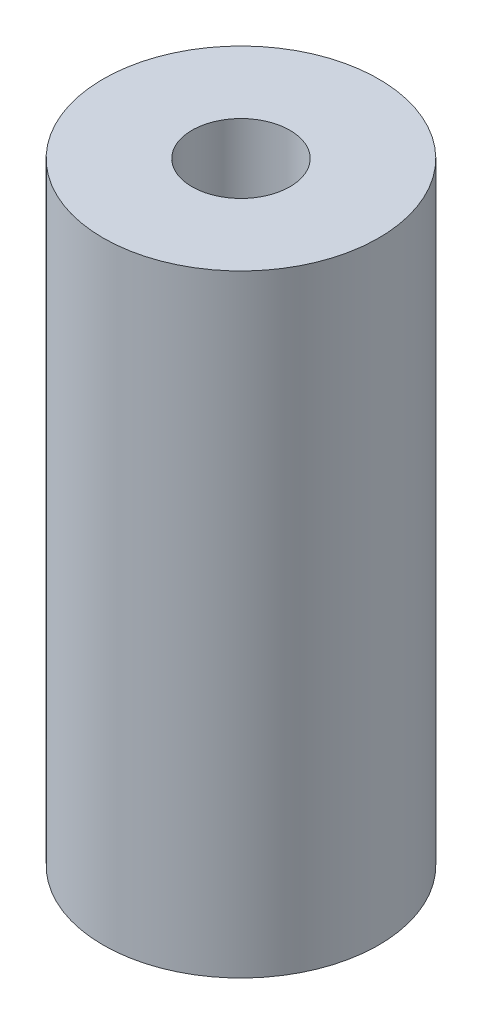
ISO-10303-21;
HEADER;
FILE_DESCRIPTION(('STEP AP214'),'2;1');
FILE_NAME('part.step','',(''),(''),'','','');
FILE_SCHEMA(('AUTOMOTIVE_DESIGN { 1 0 10303 214 1 1 1 1 }'));
ENDSEC;
DATA;
#1=APPLICATION_CONTEXT('core data for automotive mechanical design processes');
#2=APPLICATION_PROTOCOL_DEFINITION('international standard','automotive_design',2000,#1);
#3=PRODUCT_CONTEXT('',#1,'mechanical');
#4=PRODUCT('Part','Part','',(#3));
#5=PRODUCT_RELATED_PRODUCT_CATEGORY('part','',(#4));
#6=PRODUCT_DEFINITION_FORMATION('','',#4);
#7=PRODUCT_DEFINITION_CONTEXT('part definition',#1,'design');
#8=PRODUCT_DEFINITION('design','',#6,#7);
#9=PRODUCT_DEFINITION_SHAPE('','',#8);
#10=(LENGTH_UNIT() NAMED_UNIT(*) SI_UNIT(.MILLI.,.METRE.));
#11=(NAMED_UNIT(*) PLANE_ANGLE_UNIT() SI_UNIT($,.RADIAN.));
#12=(NAMED_UNIT(*) SI_UNIT($,.STERADIAN.) SOLID_ANGLE_UNIT());
#13=UNCERTAINTY_MEASURE_WITH_UNIT(LENGTH_MEASURE(1.E-05),#10,'distance_accuracy_value','');
#14=(GEOMETRIC_REPRESENTATION_CONTEXT(3) GLOBAL_UNCERTAINTY_ASSIGNED_CONTEXT((#13)) GLOBAL_UNIT_ASSIGNED_CONTEXT((#10,
#11,#12)) REPRESENTATION_CONTEXT('',''));
#15=CARTESIAN_POINT('',(0.,0.,0.));
#16=DIRECTION('',(0.,0.,1.));
#17=DIRECTION('',(1.,0.,0.));
#18=AXIS2_PLACEMENT_3D('',#15,#16,#17);
#19=CARTESIAN_POINT('',(0.,10.,0.));
#20=DIRECTION('',(0.,-1.,0.));
#21=DIRECTION('',(0.,0.,-1.));
#22=AXIS2_PLACEMENT_3D('',#19,#20,#21);
#23=CYLINDRICAL_SURFACE('',#22,2.25);
#24=CARTESIAN_POINT('',(0.,10.,0.));
#25=DIRECTION('',(0.,1.,0.));
#26=DIRECTION('',(0.,0.,1.));
#27=AXIS2_PLACEMENT_3D('',#24,#25,#26);
#28=CIRCLE('',#27,2.25);
#29=CARTESIAN_POINT('',(0.,10.,2.25));
#30=VERTEX_POINT('',#29);
#31=EDGE_CURVE('E10',#30,#30,#28,.T.);
#32=ORIENTED_EDGE('',*,*,#31,.F.);
#33=EDGE_LOOP('',(#32));
#34=FACE_BOUND('',#33,.T.);
#35=CARTESIAN_POINT('',(0.,0.,0.));
#36=DIRECTION('',(0.,1.,0.));
#37=DIRECTION('',(0.,0.,1.));
#38=AXIS2_PLACEMENT_3D('',#35,#36,#37);
#39=CIRCLE('',#38,2.25);
#40=CARTESIAN_POINT('',(0.,0.,2.25));
#41=VERTEX_POINT('',#40);
#42=EDGE_CURVE('E42',#41,#41,#39,.T.);
#43=ORIENTED_EDGE('',*,*,#42,.T.);
#44=EDGE_LOOP('',(#43));
#45=FACE_BOUND('',#44,.T.);
#46=ADVANCED_FACE('F39',(#34,#45),#23,.T.);
#47=CARTESIAN_POINT('',(0.,10.,0.));
#48=DIRECTION('',(0.,1.,0.));
#49=DIRECTION('',(0.,0.,1.));
#50=AXIS2_PLACEMENT_3D('',#47,#48,#49);
#51=PLANE('',#50);
#52=CARTESIAN_POINT('',(0.,10.,0.));
#53=DIRECTION('',(0.,1.,0.));
#54=DIRECTION('',(0.,0.,1.));
#55=AXIS2_PLACEMENT_3D('',#52,#53,#54);
#56=CIRCLE('',#55,0.799999999999999);
#57=CARTESIAN_POINT('',(0.,10.,0.799999999999999));
#58=VERTEX_POINT('',#57);
#59=EDGE_CURVE('E53',#58,#58,#56,.T.);
#60=ORIENTED_EDGE('',*,*,#59,.F.);
#61=EDGE_LOOP('',(#60));
#62=FACE_BOUND('',#61,.T.);
#63=ORIENTED_EDGE('',*,*,#31,.T.);
#64=EDGE_LOOP('',(#63));
#65=FACE_BOUND('',#64,.T.);
#66=ADVANCED_FACE('F59',(#62,#65),#51,.T.);
#67=CARTESIAN_POINT('',(0.,0.,0.));
#68=DIRECTION('',(0.,1.,0.));
#69=DIRECTION('',(0.,0.,1.));
#70=AXIS2_PLACEMENT_3D('',#67,#68,#69);
#71=PLANE('',#70);
#72=CARTESIAN_POINT('',(0.,0.,0.));
#73=DIRECTION('',(0.,1.,0.));
#74=DIRECTION('',(0.,0.,1.));
#75=AXIS2_PLACEMENT_3D('',#72,#73,#74);
#76=CIRCLE('',#75,0.799999999999998);
#77=CARTESIAN_POINT('',(0.,0.,0.799999999999998));
#78=VERTEX_POINT('',#77);
#79=EDGE_CURVE('E49',#78,#78,#76,.T.);
#80=ORIENTED_EDGE('',*,*,#79,.T.);
#81=EDGE_LOOP('',(#80));
#82=FACE_BOUND('',#81,.T.);
#83=ORIENTED_EDGE('',*,*,#42,.F.);
#84=EDGE_LOOP('',(#83));
#85=FACE_BOUND('',#84,.T.);
#86=ADVANCED_FACE('F61',(#82,#85),#71,.F.);
#87=CARTESIAN_POINT('',(0.,10.,0.));
#88=DIRECTION('',(0.,1.,0.));
#89=DIRECTION('',(0.,0.,1.));
#90=AXIS2_PLACEMENT_3D('',#87,#88,#89);
#91=CYLINDRICAL_SURFACE('',#90,0.799999999999999);
#92=ORIENTED_EDGE('',*,*,#79,.F.);
#93=EDGE_LOOP('',(#92));
#94=FACE_BOUND('',#93,.T.);
#95=ORIENTED_EDGE('',*,*,#59,.T.);
#96=EDGE_LOOP('',(#95));
#97=FACE_BOUND('',#96,.T.);
#98=ADVANCED_FACE('F57',(#94,#97),#91,.F.);
#99=CLOSED_SHELL('',(#46,#66,#86,#98));
#100=MANIFOLD_SOLID_BREP('B2',#99);
#101=ADVANCED_BREP_SHAPE_REPRESENTATION('',(#18,#100),#14);
#102=SHAPE_DEFINITION_REPRESENTATION(#9,#101);
ENDSEC;
END-ISO-10303-21;
